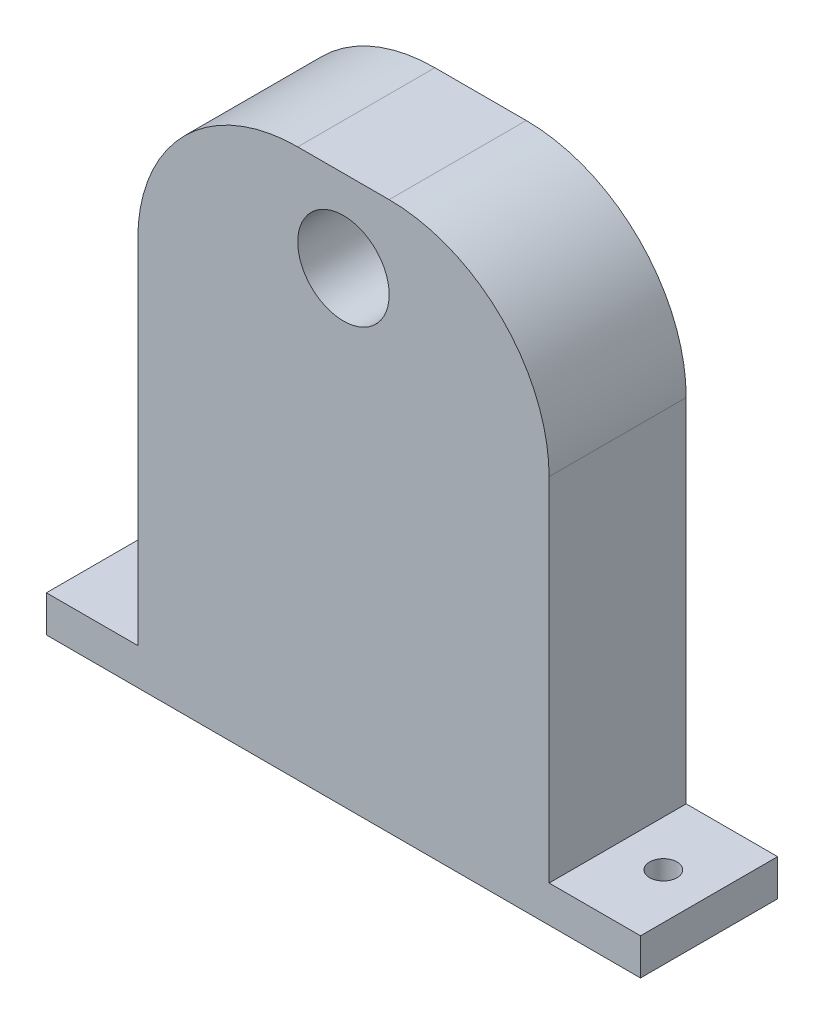
ISO-10303-21;
HEADER;
FILE_DESCRIPTION(('STEP AP214'),'2;1');
FILE_NAME('part.step','',(''),(''),'','','');
FILE_SCHEMA(('AUTOMOTIVE_DESIGN { 1 0 10303 214 1 1 1 1 }'));
ENDSEC;
DATA;
#1=APPLICATION_CONTEXT('core data for automotive mechanical design processes');
#2=APPLICATION_PROTOCOL_DEFINITION('international standard','automotive_design',2000,#1);
#3=PRODUCT_CONTEXT('',#1,'mechanical');
#4=PRODUCT('Part','Part','',(#3));
#5=PRODUCT_RELATED_PRODUCT_CATEGORY('part','',(#4));
#6=PRODUCT_DEFINITION_FORMATION('','',#4);
#7=PRODUCT_DEFINITION_CONTEXT('part definition',#1,'design');
#8=PRODUCT_DEFINITION('design','',#6,#7);
#9=PRODUCT_DEFINITION_SHAPE('','',#8);
#10=(LENGTH_UNIT() NAMED_UNIT(*) SI_UNIT(.MILLI.,.METRE.));
#11=(NAMED_UNIT(*) PLANE_ANGLE_UNIT() SI_UNIT($,.RADIAN.));
#12=(NAMED_UNIT(*) SI_UNIT($,.STERADIAN.) SOLID_ANGLE_UNIT());
#13=UNCERTAINTY_MEASURE_WITH_UNIT(LENGTH_MEASURE(1.E-05),#10,'distance_accuracy_value','');
#14=(GEOMETRIC_REPRESENTATION_CONTEXT(3) GLOBAL_UNCERTAINTY_ASSIGNED_CONTEXT((#13)) GLOBAL_UNIT_ASSIGNED_CONTEXT((#10,
#11,#12)) REPRESENTATION_CONTEXT('',''));
#15=CARTESIAN_POINT('',(0.,0.,0.));
#16=DIRECTION('',(0.,0.,1.));
#17=DIRECTION('',(1.,0.,0.));
#18=AXIS2_PLACEMENT_3D('',#15,#16,#17);
#19=CARTESIAN_POINT('',(22.5,60.,-7.5));
#20=DIRECTION('',(-1.,0.,0.));
#21=DIRECTION('',(0.,0.,1.));
#22=AXIS2_PLACEMENT_3D('',#19,#20,#21);
#23=PLANE('',#22);
#24=DIRECTION('',(0.,0.,1.));
#25=VECTOR('',#24,1.);
#26=CARTESIAN_POINT('',(22.5,42.5,-7.50105));
#27=LINE('',#26,#25);
#28=CARTESIAN_POINT('',(22.5,42.5,-7.5));
#29=VERTEX_POINT('',#28);
#30=CARTESIAN_POINT('',(22.5,42.5,7.5));
#31=VERTEX_POINT('',#30);
#32=EDGE_CURVE('E113',#29,#31,#27,.T.);
#33=ORIENTED_EDGE('',*,*,#32,.T.);
#34=DIRECTION('',(0.,-1.,0.));
#35=VECTOR('',#34,1.);
#36=CARTESIAN_POINT('',(22.5,60.,7.5));
#37=LINE('',#36,#35);
#38=CARTESIAN_POINT('',(22.5,4.,7.5));
#39=VERTEX_POINT('',#38);
#40=EDGE_CURVE('E39',#31,#39,#37,.T.);
#41=ORIENTED_EDGE('',*,*,#40,.T.);
#42=DIRECTION('',(0.,0.,-1.));
#43=VECTOR('',#42,1.);
#44=CARTESIAN_POINT('',(22.5,4.,-7.5));
#45=LINE('',#44,#43);
#46=CARTESIAN_POINT('',(22.5,4.,-7.5));
#47=VERTEX_POINT('',#46);
#48=EDGE_CURVE('E134',#39,#47,#45,.T.);
#49=ORIENTED_EDGE('',*,*,#48,.T.);
#50=DIRECTION('',(0.,-1.,0.));
#51=VECTOR('',#50,1.);
#52=CARTESIAN_POINT('',(22.5,60.,-7.5));
#53=LINE('',#52,#51);
#54=EDGE_CURVE('E127',#29,#47,#53,.T.);
#55=ORIENTED_EDGE('',*,*,#54,.F.);
#56=EDGE_LOOP('',(#33,#41,#49,#55));
#57=FACE_BOUND('',#56,.T.);
#58=ADVANCED_FACE('F35',(#57),#23,.F.);
#59=CARTESIAN_POINT('',(0.,60.,0.));
#60=DIRECTION('',(0.,-1.,0.));
#61=DIRECTION('',(0.,0.,-1.));
#62=AXIS2_PLACEMENT_3D('',#59,#60,#61);
#63=PLANE('',#62);
#64=DIRECTION('',(1.,0.,0.));
#65=VECTOR('',#64,1.);
#66=CARTESIAN_POINT('',(22.5,60.,7.5));
#67=LINE('',#66,#65);
#68=CARTESIAN_POINT('',(-4.99999999999999,60.,7.5));
#69=VERTEX_POINT('',#68);
#70=CARTESIAN_POINT('',(5.,60.,7.5));
#71=VERTEX_POINT('',#70);
#72=EDGE_CURVE('E135',#69,#71,#67,.T.);
#73=ORIENTED_EDGE('',*,*,#72,.T.);
#74=DIRECTION('',(0.,0.,1.));
#75=VECTOR('',#74,1.);
#76=CARTESIAN_POINT('',(5.,60.,-7.50105));
#77=LINE('',#76,#75);
#78=CARTESIAN_POINT('',(5.,60.,-7.5));
#79=VERTEX_POINT('',#78);
#80=EDGE_CURVE('E121',#79,#71,#77,.T.);
#81=ORIENTED_EDGE('',*,*,#80,.F.);
#82=DIRECTION('',(-1.,0.,0.));
#83=VECTOR('',#82,1.);
#84=CARTESIAN_POINT('',(-22.5,60.,-7.5));
#85=LINE('',#84,#83);
#86=CARTESIAN_POINT('',(-5.00000000000001,60.,-7.5));
#87=VERTEX_POINT('',#86);
#88=EDGE_CURVE('E130',#79,#87,#85,.T.);
#89=ORIENTED_EDGE('',*,*,#88,.T.);
#90=DIRECTION('',(0.,0.,1.));
#91=VECTOR('',#90,1.);
#92=CARTESIAN_POINT('',(-5.,60.,-7.50105));
#93=LINE('',#92,#91);
#94=EDGE_CURVE('E227',#87,#69,#93,.T.);
#95=ORIENTED_EDGE('',*,*,#94,.T.);
#96=EDGE_LOOP('',(#73,#81,#89,#95));
#97=FACE_BOUND('',#96,.T.);
#98=ADVANCED_FACE('F250',(#97),#63,.F.);
#99=CARTESIAN_POINT('',(0.,4.,0.));
#100=DIRECTION('',(0.,-1.,0.));
#101=DIRECTION('',(0.,0.,-1.));
#102=AXIS2_PLACEMENT_3D('',#99,#100,#101);
#103=PLANE('',#102);
#104=CARTESIAN_POINT('',(27.5,4.,0.));
#105=DIRECTION('',(0.,1.,0.));
#106=DIRECTION('',(0.,0.,1.));
#107=AXIS2_PLACEMENT_3D('',#104,#105,#106);
#108=CIRCLE('',#107,1.5);
#109=CARTESIAN_POINT('',(27.5,4.,1.5));
#110=VERTEX_POINT('',#109);
#111=EDGE_CURVE('E234',#110,#110,#108,.T.);
#112=ORIENTED_EDGE('',*,*,#111,.F.);
#113=EDGE_LOOP('',(#112));
#114=FACE_BOUND('',#113,.T.);
#115=ORIENTED_EDGE('',*,*,#48,.F.);
#116=DIRECTION('',(1.,0.,0.));
#117=VECTOR('',#116,1.);
#118=CARTESIAN_POINT('',(32.5,4.,7.5));
#119=LINE('',#118,#117);
#120=CARTESIAN_POINT('',(32.5,4.,7.5));
#121=VERTEX_POINT('',#120);
#122=EDGE_CURVE('E169',#39,#121,#119,.T.);
#123=ORIENTED_EDGE('',*,*,#122,.T.);
#124=DIRECTION('',(0.,0.,-1.));
#125=VECTOR('',#124,1.);
#126=CARTESIAN_POINT('',(32.5,4.,-7.5));
#127=LINE('',#126,#125);
#128=CARTESIAN_POINT('',(32.5,4.,-7.5));
#129=VERTEX_POINT('',#128);
#130=EDGE_CURVE('E166',#121,#129,#127,.T.);
#131=ORIENTED_EDGE('',*,*,#130,.T.);
#132=DIRECTION('',(-1.,0.,0.));
#133=VECTOR('',#132,1.);
#134=CARTESIAN_POINT('',(-32.5,4.,-7.5));
#135=LINE('',#134,#133);
#136=EDGE_CURVE('E192',#129,#47,#135,.T.);
#137=ORIENTED_EDGE('',*,*,#136,.T.);
#138=EDGE_LOOP('',(#115,#123,#131,#137));
#139=FACE_BOUND('',#138,.T.);
#140=ADVANCED_FACE('F202',(#114,#139),#103,.F.);
#141=CARTESIAN_POINT('',(-27.5,4.,0.));
#142=DIRECTION('',(0.,1.,0.));
#143=DIRECTION('',(0.,0.,1.));
#144=AXIS2_PLACEMENT_3D('',#141,#142,#143);
#145=CIRCLE('',#144,1.5);
#146=CARTESIAN_POINT('',(-27.5,4.,1.5));
#147=VERTEX_POINT('',#146);
#148=EDGE_CURVE('E240',#147,#147,#145,.T.);
#149=ORIENTED_EDGE('',*,*,#148,.F.);
#150=EDGE_LOOP('',(#149));
#151=FACE_BOUND('',#150,.T.);
#152=DIRECTION('',(0.,0.,1.));
#153=VECTOR('',#152,1.);
#154=CARTESIAN_POINT('',(-22.5,4.,7.5));
#155=LINE('',#154,#153);
#156=CARTESIAN_POINT('',(-22.5,4.,-7.5));
#157=VERTEX_POINT('',#156);
#158=CARTESIAN_POINT('',(-22.5,4.,7.5));
#159=VERTEX_POINT('',#158);
#160=EDGE_CURVE('E151',#157,#159,#155,.T.);
#161=ORIENTED_EDGE('',*,*,#160,.F.);
#162=CARTESIAN_POINT('',(-32.5,4.,-7.5));
#163=VERTEX_POINT('',#162);
#164=EDGE_CURVE('E157',#157,#163,#135,.T.);
#165=ORIENTED_EDGE('',*,*,#164,.T.);
#166=DIRECTION('',(0.,0.,1.));
#167=VECTOR('',#166,1.);
#168=CARTESIAN_POINT('',(-32.5,4.,7.5));
#169=LINE('',#168,#167);
#170=CARTESIAN_POINT('',(-32.5,4.,7.5));
#171=VERTEX_POINT('',#170);
#172=EDGE_CURVE('E182',#163,#171,#169,.T.);
#173=ORIENTED_EDGE('',*,*,#172,.T.);
#174=EDGE_CURVE('E171',#171,#159,#119,.T.);
#175=ORIENTED_EDGE('',*,*,#174,.T.);
#176=EDGE_LOOP('',(#161,#165,#173,#175));
#177=FACE_BOUND('',#176,.T.);
#178=ADVANCED_FACE('F219',(#151,#177),#103,.F.);
#179=CARTESIAN_POINT('',(32.5,4.,7.5));
#180=DIRECTION('',(0.,0.,-1.));
#181=DIRECTION('',(-1.,0.,0.));
#182=AXIS2_PLACEMENT_3D('',#179,#180,#181);
#183=PLANE('',#182);
#184=CARTESIAN_POINT('',(0.,51.,7.5));
#185=DIRECTION('',(0.,0.,1.));
#186=DIRECTION('',(1.,0.,0.));
#187=AXIS2_PLACEMENT_3D('',#184,#185,#186);
#188=CIRCLE('',#187,5.);
#189=CARTESIAN_POINT('',(5.,51.,7.5));
#190=VERTEX_POINT('',#189);
#191=EDGE_CURVE('E243',#190,#190,#188,.T.);
#192=ORIENTED_EDGE('',*,*,#191,.F.);
#193=EDGE_LOOP('',(#192));
#194=FACE_BOUND('',#193,.T.);
#195=ORIENTED_EDGE('',*,*,#40,.F.);
#196=CARTESIAN_POINT('',(5.,42.5,7.5));
#197=DIRECTION('',(0.,0.,-1.));
#198=DIRECTION('',(1.,0.,0.));
#199=AXIS2_PLACEMENT_3D('',#196,#197,#198);
#200=CIRCLE('',#199,17.5);
#201=EDGE_CURVE('E53',#71,#31,#200,.T.);
#202=ORIENTED_EDGE('',*,*,#201,.F.);
#203=ORIENTED_EDGE('',*,*,#72,.F.);
#204=CARTESIAN_POINT('',(-5.,42.5,7.5));
#205=DIRECTION('',(0.,0.,-1.));
#206=DIRECTION('',(1.,0.,0.));
#207=AXIS2_PLACEMENT_3D('',#204,#205,#206);
#208=CIRCLE('',#207,17.5);
#209=CARTESIAN_POINT('',(-22.5,42.5,7.5));
#210=VERTEX_POINT('',#209);
#211=EDGE_CURVE('E61',#210,#69,#208,.T.);
#212=ORIENTED_EDGE('',*,*,#211,.F.);
#213=DIRECTION('',(0.,-1.,0.));
#214=VECTOR('',#213,1.);
#215=CARTESIAN_POINT('',(-22.5,60.,7.5));
#216=LINE('',#215,#214);
#217=EDGE_CURVE('E136',#210,#159,#216,.T.);
#218=ORIENTED_EDGE('',*,*,#217,.T.);
#219=ORIENTED_EDGE('',*,*,#174,.F.);
#220=DIRECTION('',(0.,-1.,0.));
#221=VECTOR('',#220,1.);
#222=CARTESIAN_POINT('',(-32.5,4.,7.5));
#223=LINE('',#222,#221);
#224=CARTESIAN_POINT('',(-32.5,0.,7.5));
#225=VERTEX_POINT('',#224);
#226=EDGE_CURVE('E179',#171,#225,#223,.T.);
#227=ORIENTED_EDGE('',*,*,#226,.T.);
#228=DIRECTION('',(1.,0.,0.));
#229=VECTOR('',#228,1.);
#230=CARTESIAN_POINT('',(32.5,0.,7.5));
#231=LINE('',#230,#229);
#232=CARTESIAN_POINT('',(32.5,0.,7.5));
#233=VERTEX_POINT('',#232);
#234=EDGE_CURVE('E189',#225,#233,#231,.T.);
#235=ORIENTED_EDGE('',*,*,#234,.T.);
#236=DIRECTION('',(0.,-1.,0.));
#237=VECTOR('',#236,1.);
#238=CARTESIAN_POINT('',(32.5,4.,7.5));
#239=LINE('',#238,#237);
#240=EDGE_CURVE('E11',#121,#233,#239,.T.);
#241=ORIENTED_EDGE('',*,*,#240,.F.);
#242=ORIENTED_EDGE('',*,*,#122,.F.);
#243=EDGE_LOOP('',(#195,#202,#203,#212,#218,#219,#227,#235,#241,#242));
#244=FACE_BOUND('',#243,.T.);
#245=ADVANCED_FACE('F37',(#194,#244),#183,.F.);
#246=CARTESIAN_POINT('',(32.5,4.,-7.5));
#247=DIRECTION('',(-1.,0.,0.));
#248=DIRECTION('',(0.,0.,1.));
#249=AXIS2_PLACEMENT_3D('',#246,#247,#248);
#250=PLANE('',#249);
#251=DIRECTION('',(0.,0.,-1.));
#252=VECTOR('',#251,1.);
#253=CARTESIAN_POINT('',(32.5,0.,-7.5));
#254=LINE('',#253,#252);
#255=CARTESIAN_POINT('',(32.5,0.,-7.5));
#256=VERTEX_POINT('',#255);
#257=EDGE_CURVE('E187',#233,#256,#254,.T.);
#258=ORIENTED_EDGE('',*,*,#257,.T.);
#259=DIRECTION('',(0.,-1.,0.));
#260=VECTOR('',#259,1.);
#261=CARTESIAN_POINT('',(32.5,4.,-7.5));
#262=LINE('',#261,#260);
#263=EDGE_CURVE('E45',#129,#256,#262,.T.);
#264=ORIENTED_EDGE('',*,*,#263,.F.);
#265=ORIENTED_EDGE('',*,*,#130,.F.);
#266=ORIENTED_EDGE('',*,*,#240,.T.);
#267=EDGE_LOOP('',(#258,#264,#265,#266));
#268=FACE_BOUND('',#267,.T.);
#269=ADVANCED_FACE('F206',(#268),#250,.F.);
#270=CARTESIAN_POINT('',(-32.5,4.,-7.5));
#271=DIRECTION('',(0.,0.,1.));
#272=DIRECTION('',(1.,0.,0.));
#273=AXIS2_PLACEMENT_3D('',#270,#271,#272);
#274=PLANE('',#273);
#275=ORIENTED_EDGE('',*,*,#88,.F.);
#276=CARTESIAN_POINT('',(5.,42.5,-7.5));
#277=DIRECTION('',(0.,0.,1.));
#278=DIRECTION('',(1.,0.,0.));
#279=AXIS2_PLACEMENT_3D('',#276,#277,#278);
#280=CIRCLE('',#279,17.5);
#281=EDGE_CURVE('E116',#29,#79,#280,.T.);
#282=ORIENTED_EDGE('',*,*,#281,.F.);
#283=ORIENTED_EDGE('',*,*,#54,.T.);
#284=ORIENTED_EDGE('',*,*,#136,.F.);
#285=ORIENTED_EDGE('',*,*,#263,.T.);
#286=DIRECTION('',(-1.,0.,0.));
#287=VECTOR('',#286,1.);
#288=CARTESIAN_POINT('',(-32.5,0.,-7.5));
#289=LINE('',#288,#287);
#290=CARTESIAN_POINT('',(-32.5,0.,-7.5));
#291=VERTEX_POINT('',#290);
#292=EDGE_CURVE('E185',#256,#291,#289,.T.);
#293=ORIENTED_EDGE('',*,*,#292,.T.);
#294=DIRECTION('',(0.,-1.,0.));
#295=VECTOR('',#294,1.);
#296=CARTESIAN_POINT('',(-32.5,4.,-7.5));
#297=LINE('',#296,#295);
#298=EDGE_CURVE('E176',#163,#291,#297,.T.);
#299=ORIENTED_EDGE('',*,*,#298,.F.);
#300=ORIENTED_EDGE('',*,*,#164,.F.);
#301=DIRECTION('',(0.,-1.,0.));
#302=VECTOR('',#301,1.);
#303=CARTESIAN_POINT('',(-22.5,60.,-7.5));
#304=LINE('',#303,#302);
#305=CARTESIAN_POINT('',(-22.5,42.5,-7.5));
#306=VERTEX_POINT('',#305);
#307=EDGE_CURVE('E141',#306,#157,#304,.T.);
#308=ORIENTED_EDGE('',*,*,#307,.F.);
#309=CARTESIAN_POINT('',(-5.,42.5,-7.5));
#310=DIRECTION('',(0.,0.,1.));
#311=DIRECTION('',(1.,0.,0.));
#312=AXIS2_PLACEMENT_3D('',#309,#310,#311);
#313=CIRCLE('',#312,17.5);
#314=EDGE_CURVE('E225',#87,#306,#313,.T.);
#315=ORIENTED_EDGE('',*,*,#314,.F.);
#316=EDGE_LOOP('',(#275,#282,#283,#284,#285,#293,#299,#300,#308,#315));
#317=FACE_BOUND('',#316,.T.);
#318=ADVANCED_FACE('F125',(#317),#274,.F.);
#319=CARTESIAN_POINT('',(-32.5,4.,7.5));
#320=DIRECTION('',(1.,0.,0.));
#321=DIRECTION('',(0.,0.,-1.));
#322=AXIS2_PLACEMENT_3D('',#319,#320,#321);
#323=PLANE('',#322);
#324=DIRECTION('',(0.,0.,1.));
#325=VECTOR('',#324,1.);
#326=CARTESIAN_POINT('',(-32.5,0.,7.5));
#327=LINE('',#326,#325);
#328=EDGE_CURVE('E183',#291,#225,#327,.T.);
#329=ORIENTED_EDGE('',*,*,#328,.T.);
#330=ORIENTED_EDGE('',*,*,#226,.F.);
#331=ORIENTED_EDGE('',*,*,#172,.F.);
#332=ORIENTED_EDGE('',*,*,#298,.T.);
#333=EDGE_LOOP('',(#329,#330,#331,#332));
#334=FACE_BOUND('',#333,.T.);
#335=ADVANCED_FACE('F214',(#334),#323,.F.);
#336=CARTESIAN_POINT('',(0.,0.,0.));
#337=DIRECTION('',(0.,-1.,0.));
#338=DIRECTION('',(0.,0.,-1.));
#339=AXIS2_PLACEMENT_3D('',#336,#337,#338);
#340=PLANE('',#339);
#341=CARTESIAN_POINT('',(27.5,0.,0.));
#342=DIRECTION('',(0.,-1.,0.));
#343=DIRECTION('',(0.,0.,-1.));
#344=AXIS2_PLACEMENT_3D('',#341,#342,#343);
#345=CIRCLE('',#344,1.5);
#346=CARTESIAN_POINT('',(27.5,0.,-1.5));
#347=VERTEX_POINT('',#346);
#348=EDGE_CURVE('E232',#347,#347,#345,.F.);
#349=ORIENTED_EDGE('',*,*,#348,.T.);
#350=EDGE_LOOP('',(#349));
#351=FACE_BOUND('',#350,.T.);
#352=CARTESIAN_POINT('',(-27.5,0.,0.));
#353=DIRECTION('',(0.,-1.,0.));
#354=DIRECTION('',(0.,0.,-1.));
#355=AXIS2_PLACEMENT_3D('',#352,#353,#354);
#356=CIRCLE('',#355,1.5);
#357=CARTESIAN_POINT('',(-27.5,0.,-1.5));
#358=VERTEX_POINT('',#357);
#359=EDGE_CURVE('E237',#358,#358,#356,.F.);
#360=ORIENTED_EDGE('',*,*,#359,.T.);
#361=EDGE_LOOP('',(#360));
#362=FACE_BOUND('',#361,.T.);
#363=ORIENTED_EDGE('',*,*,#234,.F.);
#364=ORIENTED_EDGE('',*,*,#328,.F.);
#365=ORIENTED_EDGE('',*,*,#292,.F.);
#366=ORIENTED_EDGE('',*,*,#257,.F.);
#367=EDGE_LOOP('',(#363,#364,#365,#366));
#368=FACE_BOUND('',#367,.T.);
#369=ADVANCED_FACE('F211',(#351,#362,#368),#340,.T.);
#370=CARTESIAN_POINT('',(-22.5,60.,7.5));
#371=DIRECTION('',(1.,0.,0.));
#372=DIRECTION('',(0.,0.,-1.));
#373=AXIS2_PLACEMENT_3D('',#370,#371,#372);
#374=PLANE('',#373);
#375=ORIENTED_EDGE('',*,*,#217,.F.);
#376=DIRECTION('',(0.,0.,1.));
#377=VECTOR('',#376,1.);
#378=CARTESIAN_POINT('',(-22.5,42.5,-7.50105));
#379=LINE('',#378,#377);
#380=EDGE_CURVE('E224',#306,#210,#379,.T.);
#381=ORIENTED_EDGE('',*,*,#380,.F.);
#382=ORIENTED_EDGE('',*,*,#307,.T.);
#383=ORIENTED_EDGE('',*,*,#160,.T.);
#384=EDGE_LOOP('',(#375,#381,#382,#383));
#385=FACE_BOUND('',#384,.T.);
#386=ADVANCED_FACE('F221',(#385),#374,.F.);
#387=CARTESIAN_POINT('',(0.,51.,-2.5));
#388=DIRECTION('',(0.,0.,1.));
#389=DIRECTION('',(1.,0.,0.));
#390=AXIS2_PLACEMENT_3D('',#387,#388,#389);
#391=CYLINDRICAL_SURFACE('',#390,5.);
#392=CARTESIAN_POINT('',(0.,51.,-2.5));
#393=DIRECTION('',(0.,0.,1.));
#394=DIRECTION('',(1.,0.,0.));
#395=AXIS2_PLACEMENT_3D('',#392,#393,#394);
#396=CIRCLE('',#395,5.);
#397=CARTESIAN_POINT('',(5.,51.,-2.5));
#398=VERTEX_POINT('',#397);
#399=EDGE_CURVE('E156',#398,#398,#396,.T.);
#400=ORIENTED_EDGE('',*,*,#399,.F.);
#401=EDGE_LOOP('',(#400));
#402=FACE_BOUND('',#401,.T.);
#403=ORIENTED_EDGE('',*,*,#191,.T.);
#404=EDGE_LOOP('',(#403));
#405=FACE_BOUND('',#404,.T.);
#406=ADVANCED_FACE('F276',(#402,#405),#391,.F.);
#407=CARTESIAN_POINT('',(0.,51.,-2.5));
#408=DIRECTION('',(0.,0.,1.));
#409=DIRECTION('',(1.,0.,0.));
#410=AXIS2_PLACEMENT_3D('',#407,#408,#409);
#411=PLANE('',#410);
#412=ORIENTED_EDGE('',*,*,#399,.T.);
#413=EDGE_LOOP('',(#412));
#414=FACE_BOUND('',#413,.T.);
#415=ADVANCED_FACE('F299',(#414),#411,.T.);
#416=CARTESIAN_POINT('',(-27.5,-0.00100000000000013,0.));
#417=DIRECTION('',(0.,1.,0.));
#418=DIRECTION('',(0.,0.,1.));
#419=AXIS2_PLACEMENT_3D('',#416,#417,#418);
#420=CYLINDRICAL_SURFACE('',#419,1.5);
#421=ORIENTED_EDGE('',*,*,#359,.F.);
#422=EDGE_LOOP('',(#421));
#423=FACE_BOUND('',#422,.T.);
#424=ORIENTED_EDGE('',*,*,#148,.T.);
#425=EDGE_LOOP('',(#424));
#426=FACE_BOUND('',#425,.T.);
#427=ADVANCED_FACE('F262',(#423,#426),#420,.F.);
#428=CARTESIAN_POINT('',(27.5,-0.00100000000000013,0.));
#429=DIRECTION('',(0.,1.,0.));
#430=DIRECTION('',(0.,0.,1.));
#431=AXIS2_PLACEMENT_3D('',#428,#429,#430);
#432=CYLINDRICAL_SURFACE('',#431,1.5);
#433=ORIENTED_EDGE('',*,*,#348,.F.);
#434=EDGE_LOOP('',(#433));
#435=FACE_BOUND('',#434,.T.);
#436=ORIENTED_EDGE('',*,*,#111,.T.);
#437=EDGE_LOOP('',(#436));
#438=FACE_BOUND('',#437,.T.);
#439=ADVANCED_FACE('F254',(#435,#438),#432,.F.);
#440=CARTESIAN_POINT('',(-5.,42.5,-7.50105));
#441=DIRECTION('',(0.,0.,1.));
#442=DIRECTION('',(1.,0.,0.));
#443=AXIS2_PLACEMENT_3D('',#440,#441,#442);
#444=CYLINDRICAL_SURFACE('',#443,17.5);
#445=ORIENTED_EDGE('',*,*,#314,.T.);
#446=ORIENTED_EDGE('',*,*,#380,.T.);
#447=ORIENTED_EDGE('',*,*,#211,.T.);
#448=ORIENTED_EDGE('',*,*,#94,.F.);
#449=EDGE_LOOP('',(#445,#446,#447,#448));
#450=FACE_BOUND('',#449,.T.);
#451=ADVANCED_FACE('F252',(#450),#444,.T.);
#452=CARTESIAN_POINT('',(5.,42.5,-7.50105));
#453=DIRECTION('',(0.,0.,1.));
#454=DIRECTION('',(1.,0.,0.));
#455=AXIS2_PLACEMENT_3D('',#452,#453,#454);
#456=CYLINDRICAL_SURFACE('',#455,17.5);
#457=ORIENTED_EDGE('',*,*,#281,.T.);
#458=ORIENTED_EDGE('',*,*,#80,.T.);
#459=ORIENTED_EDGE('',*,*,#201,.T.);
#460=ORIENTED_EDGE('',*,*,#32,.F.);
#461=EDGE_LOOP('',(#457,#458,#459,#460));
#462=FACE_BOUND('',#461,.T.);
#463=ADVANCED_FACE('F115',(#462),#456,.T.);
#464=CLOSED_SHELL('',(#58,#98,#140,#178,#245,#269,#318,#335,#369,#386,#406,#415,#427,#439,#451,#463));
#465=MANIFOLD_SOLID_BREP('B2',#464);
#466=ADVANCED_BREP_SHAPE_REPRESENTATION('',(#18,#465),#14);
#467=SHAPE_DEFINITION_REPRESENTATION(#9,#466);
ENDSEC;
END-ISO-10303-21;
